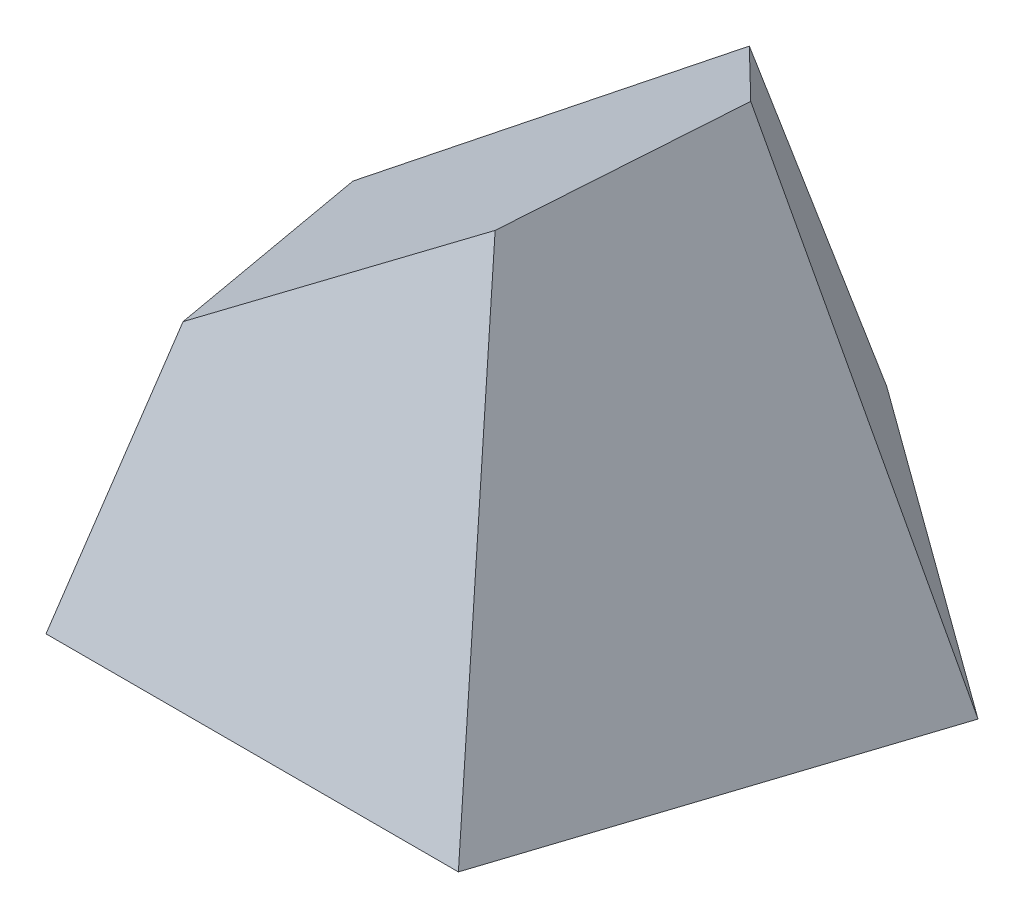
ISO-10303-21;
HEADER;
FILE_DESCRIPTION(('STEP AP214'),'2;1');
FILE_NAME('part.step','',(''),(''),'','','');
FILE_SCHEMA(('AUTOMOTIVE_DESIGN { 1 0 10303 214 1 1 1 1 }'));
ENDSEC;
DATA;
#1=APPLICATION_CONTEXT('core data for automotive mechanical design processes');
#2=APPLICATION_PROTOCOL_DEFINITION('international standard','automotive_design',2000,#1);
#3=PRODUCT_CONTEXT('',#1,'mechanical');
#4=PRODUCT('Part','Part','',(#3));
#5=PRODUCT_RELATED_PRODUCT_CATEGORY('part','',(#4));
#6=PRODUCT_DEFINITION_FORMATION('','',#4);
#7=PRODUCT_DEFINITION_CONTEXT('part definition',#1,'design');
#8=PRODUCT_DEFINITION('design','',#6,#7);
#9=PRODUCT_DEFINITION_SHAPE('','',#8);
#10=(LENGTH_UNIT() NAMED_UNIT(*) SI_UNIT(.MILLI.,.METRE.));
#11=(NAMED_UNIT(*) PLANE_ANGLE_UNIT() SI_UNIT($,.RADIAN.));
#12=(NAMED_UNIT(*) SI_UNIT($,.STERADIAN.) SOLID_ANGLE_UNIT());
#13=UNCERTAINTY_MEASURE_WITH_UNIT(LENGTH_MEASURE(1.E-05),#10,'distance_accuracy_value','');
#14=(GEOMETRIC_REPRESENTATION_CONTEXT(3) GLOBAL_UNCERTAINTY_ASSIGNED_CONTEXT((#13)) GLOBAL_UNIT_ASSIGNED_CONTEXT((#10,
#11,#12)) REPRESENTATION_CONTEXT('',''));
#15=CARTESIAN_POINT('',(0.,0.,0.));
#16=DIRECTION('',(0.,0.,1.));
#17=DIRECTION('',(1.,0.,0.));
#18=AXIS2_PLACEMENT_3D('',#15,#16,#17);
#19=CARTESIAN_POINT('',(23.7379626511837,-12.3523958960938,32.6725026219091));
#20=DIRECTION('',(-0.562081088685118,0.292487111685627,-0.77363824830495));
#21=DIRECTION('',(-0.809016994374947,0.,0.587785252292473));
#22=AXIS2_PLACEMENT_3D('',#19,#20,#21);
#23=PLANE('',#22);
#24=DIRECTION('',(-0.336329081980767,-0.935382618311236,-0.109279943151483));
#25=VECTOR('',#24,1.);
#26=CARTESIAN_POINT('',(50.3606797749979,90.,52.0260323340816));
#27=LINE('',#26,#25);
#28=CARTESIAN_POINT('',(24.0567353762153,16.8447074551422,43.4793627103019));
#29=VERTEX_POINT('',#28);
#30=CARTESIAN_POINT('',(18.,0.,41.5114100916989));
#31=VERTEX_POINT('',#30);
#32=EDGE_CURVE('E46',#29,#31,#27,.T.);
#33=ORIENTED_EDGE('',*,*,#32,.F.);
#34=DIRECTION('',(0.766161914690791,0.536472348155678,-0.3538267091977));
#35=VECTOR('',#34,1.);
#36=CARTESIAN_POINT('',(14.7985004026963,10.3620215361674,47.7549743673775));
#37=LINE('',#36,#35);
#38=CARTESIAN_POINT('',(50.3606797749979,35.2629276078189,31.3317501664225));
#39=VERTEX_POINT('',#38);
#40=EDGE_CURVE('E109',#29,#39,#37,.T.);
#41=ORIENTED_EDGE('',*,*,#40,.T.);
#42=DIRECTION('',(0.,-0.935382618311236,-0.353637324615511));
#43=VECTOR('',#42,1.);
#44=CARTESIAN_POINT('',(50.3606797749979,90.,52.0260323340816));
#45=LINE('',#44,#43);
#46=CARTESIAN_POINT('',(50.3606797749979,0.,18.));
#47=VERTEX_POINT('',#46);
#48=EDGE_CURVE('E107',#39,#47,#45,.T.);
#49=ORIENTED_EDGE('',*,*,#48,.T.);
#50=DIRECTION('',(-0.809016994374947,0.,0.587785252292473));
#51=VECTOR('',#50,1.);
#52=CARTESIAN_POINT('',(50.3606797749979,0.,18.));
#53=LINE('',#52,#51);
#54=EDGE_CURVE('E134',#47,#31,#53,.T.);
#55=ORIENTED_EDGE('',*,*,#54,.T.);
#56=EDGE_LOOP('',(#33,#41,#49,#55));
#57=FACE_BOUND('',#56,.T.);
#58=ADVANCED_FACE('F41',(#57),#23,.T.);
#59=CARTESIAN_POINT('',(3.73210946675771,-1.2002576800413,-1.21263587424687));
#60=DIRECTION('',(-0.909466305926064,0.292487111685628,0.29550351585556));
#61=DIRECTION('',(0.309016994374947,0.,0.951056516295153));
#62=AXIS2_PLACEMENT_3D('',#59,#60,#61);
#63=PLANE('',#62);
#64=DIRECTION('',(-0.207862804069164,-0.935382618311236,0.286098605459239));
#65=VECTOR('',#64,1.);
#66=CARTESIAN_POINT('',(50.3606797749979,90.,52.0260323340816));
#67=LINE('',#66,#65);
#68=CARTESIAN_POINT('',(35.9554002912885,25.1762423233079,71.8531985747935));
#69=VERTEX_POINT('',#68);
#70=CARTESIAN_POINT('',(30.3606797749979,0.,79.5536707435051));
#71=VERTEX_POINT('',#70);
#72=EDGE_CURVE('E66',#69,#71,#67,.T.);
#73=ORIENTED_EDGE('',*,*,#72,.F.);
#74=DIRECTION('',(-0.373281962832707,-0.261374844253179,-0.890136937226732));
#75=VECTOR('',#74,1.);
#76=CARTESIAN_POINT('',(4.61422677927974,3.23091637386079,-2.88370000815264));
#77=LINE('',#76,#75);
#78=EDGE_CURVE('E60',#69,#29,#77,.T.);
#79=ORIENTED_EDGE('',*,*,#78,.T.);
#80=ORIENTED_EDGE('',*,*,#32,.T.);
#81=DIRECTION('',(0.309016994374947,0.,0.951056516295154));
#82=VECTOR('',#81,1.);
#83=CARTESIAN_POINT('',(18.,0.,41.5114100916989));
#84=LINE('',#83,#82);
#85=EDGE_CURVE('E52',#31,#71,#84,.T.);
#86=ORIENTED_EDGE('',*,*,#85,.T.);
#87=EDGE_LOOP('',(#73,#79,#80,#86));
#88=FACE_BOUND('',#87,.T.);
#89=ADVANCED_FACE('F218',(#88),#63,.T.);
#90=CARTESIAN_POINT('',(8.08345521237866,4.20634409358908,-11.1259216092565));
#91=DIRECTION('',(0.562081088685118,0.292487111685628,-0.77363824830495));
#92=DIRECTION('',(-0.809016994374947,0.,-0.587785252292473));
#93=AXIS2_PLACEMENT_3D('',#90,#91,#92);
#94=PLANE('',#93);
#95=ORIENTED_EDGE('',*,*,#48,.F.);
#96=DIRECTION('',(0.635911221423305,0.445269830872743,0.630358387096165));
#97=VECTOR('',#96,1.);
#98=CARTESIAN_POINT('',(7.45150769306335,5.21760185771062,-11.2027351421722));
#99=LINE('',#98,#97);
#100=CARTESIAN_POINT('',(66.0835767824732,46.272218614948,46.9173534145114));
#101=VERTEX_POINT('',#100);
#102=EDGE_CURVE('E101',#39,#101,#99,.T.);
#103=ORIENTED_EDGE('',*,*,#102,.T.);
#104=DIRECTION('',(0.336329081980767,-0.935382618311236,-0.109279943151483));
#105=VECTOR('',#104,1.);
#106=CARTESIAN_POINT('',(50.3606797749979,90.,52.0260323340816));
#107=LINE('',#106,#105);
#108=CARTESIAN_POINT('',(82.7213595499958,0.,41.5114100916989));
#109=VERTEX_POINT('',#108);
#110=EDGE_CURVE('E100',#101,#109,#107,.T.);
#111=ORIENTED_EDGE('',*,*,#110,.T.);
#112=DIRECTION('',(-0.809016994374947,0.,-0.587785252292473));
#113=VECTOR('',#112,1.);
#114=CARTESIAN_POINT('',(82.7213595499958,0.,41.5114100916989));
#115=LINE('',#114,#113);
#116=EDGE_CURVE('E187',#109,#47,#115,.T.);
#117=ORIENTED_EDGE('',*,*,#116,.T.);
#118=EDGE_LOOP('',(#95,#103,#111,#117));
#119=FACE_BOUND('',#118,.T.);
#120=ADVANCED_FACE('F226',(#119),#94,.T.);
#121=CARTESIAN_POINT('',(79.5774440702614,25.5923464341377,25.8562789543004));
#122=DIRECTION('',(0.909466305926064,0.292487111685628,0.29550351585556));
#123=DIRECTION('',(0.309016994374948,0.,-0.951056516295154));
#124=AXIS2_PLACEMENT_3D('',#121,#122,#123);
#125=PLANE('',#124);
#126=ORIENTED_EDGE('',*,*,#110,.F.);
#127=DIRECTION('',(-0.252306550264291,-0.176666948434744,0.951383305521223));
#128=VECTOR('',#127,1.);
#129=CARTESIAN_POINT('',(71.0762934391228,49.7681564540793,28.0910991164817));
#130=LINE('',#129,#128);
#131=CARTESIAN_POINT('',(60.8866197475832,42.6332701233661,66.5137458083129));
#132=VERTEX_POINT('',#131);
#133=EDGE_CURVE('E91',#101,#132,#130,.T.);
#134=ORIENTED_EDGE('',*,*,#133,.T.);
#135=DIRECTION('',(0.207862804069164,-0.935382618311236,0.286098605459239));
#136=VECTOR('',#135,1.);
#137=CARTESIAN_POINT('',(50.3606797749979,90.,52.0260323340816));
#138=LINE('',#137,#136);
#139=CARTESIAN_POINT('',(70.3606797749979,0.,79.5536707435051));
#140=VERTEX_POINT('',#139);
#141=EDGE_CURVE('E98',#132,#140,#138,.T.);
#142=ORIENTED_EDGE('',*,*,#141,.T.);
#143=DIRECTION('',(0.309016994374948,0.,-0.951056516295154));
#144=VECTOR('',#143,1.);
#145=CARTESIAN_POINT('',(70.3606797749979,0.,79.5536707435051));
#146=LINE('',#145,#144);
#147=EDGE_CURVE('E180',#140,#109,#146,.T.);
#148=ORIENTED_EDGE('',*,*,#147,.T.);
#149=EDGE_LOOP('',(#126,#134,#142,#148));
#150=FACE_BOUND('',#149,.T.);
#151=ADVANCED_FACE('F96',(#150),#125,.T.);
#152=CARTESIAN_POINT('',(0.,22.2508827743987,72.7479567956815));
#153=DIRECTION('',(0.,0.292487111685628,0.95626946489878));
#154=DIRECTION('',(0.,-0.95626946489878,0.292487111685628));
#155=AXIS2_PLACEMENT_3D('',#152,#153,#154);
#156=PLANE('',#155);
#157=ORIENTED_EDGE('',*,*,#141,.F.);
#158=DIRECTION('',(-0.806829970628981,-0.564948427487933,0.172796622576224));
#159=VECTOR('',#158,1.);
#160=CARTESIAN_POINT('',(11.0911734070342,7.76612322719643,77.1783037208241));
#161=LINE('',#160,#159);
#162=EDGE_CURVE('E13',#132,#69,#161,.T.);
#163=ORIENTED_EDGE('',*,*,#162,.T.);
#164=ORIENTED_EDGE('',*,*,#72,.T.);
#165=DIRECTION('',(1.,0.,0.));
#166=VECTOR('',#165,1.);
#167=CARTESIAN_POINT('',(30.3606797749979,0.,79.5536707435051));
#168=LINE('',#167,#166);
#169=EDGE_CURVE('E104',#71,#140,#168,.T.);
#170=ORIENTED_EDGE('',*,*,#169,.T.);
#171=EDGE_LOOP('',(#157,#163,#164,#170));
#172=FACE_BOUND('',#171,.T.);
#173=ADVANCED_FACE('F43',(#172),#156,.T.);
#174=CARTESIAN_POINT('',(0.,0.,0.));
#175=DIRECTION('',(0.,1.,0.));
#176=DIRECTION('',(0.,0.,1.));
#177=AXIS2_PLACEMENT_3D('',#174,#175,#176);
#178=PLANE('',#177);
#179=ORIENTED_EDGE('',*,*,#169,.F.);
#180=ORIENTED_EDGE('',*,*,#85,.F.);
#181=ORIENTED_EDGE('',*,*,#54,.F.);
#182=ORIENTED_EDGE('',*,*,#116,.F.);
#183=ORIENTED_EDGE('',*,*,#147,.F.);
#184=EDGE_LOOP('',(#179,#180,#181,#182,#183));
#185=FACE_BOUND('',#184,.T.);
#186=ADVANCED_FACE('F150',(#185),#178,.F.);
#187=CARTESIAN_POINT('',(0.,0.,0.));
#188=DIRECTION('',(-0.573576436351047,0.819152044288991,0.));
#189=DIRECTION('',(-0.819152044288991,-0.573576436351047,0.));
#190=AXIS2_PLACEMENT_3D('',#187,#188,#189);
#191=PLANE('',#190);
#192=ORIENTED_EDGE('',*,*,#40,.F.);
#193=ORIENTED_EDGE('',*,*,#78,.F.);
#194=ORIENTED_EDGE('',*,*,#162,.F.);
#195=ORIENTED_EDGE('',*,*,#133,.F.);
#196=ORIENTED_EDGE('',*,*,#102,.F.);
#197=EDGE_LOOP('',(#192,#193,#194,#195,#196));
#198=FACE_BOUND('',#197,.T.);
#199=ADVANCED_FACE('F90',(#198),#191,.T.);
#200=CLOSED_SHELL('',(#58,#89,#120,#151,#173,#186,#199));
#201=MANIFOLD_SOLID_BREP('B2',#200);
#202=ADVANCED_BREP_SHAPE_REPRESENTATION('',(#18,#201),#14);
#203=SHAPE_DEFINITION_REPRESENTATION(#9,#202);
ENDSEC;
END-ISO-10303-21;
